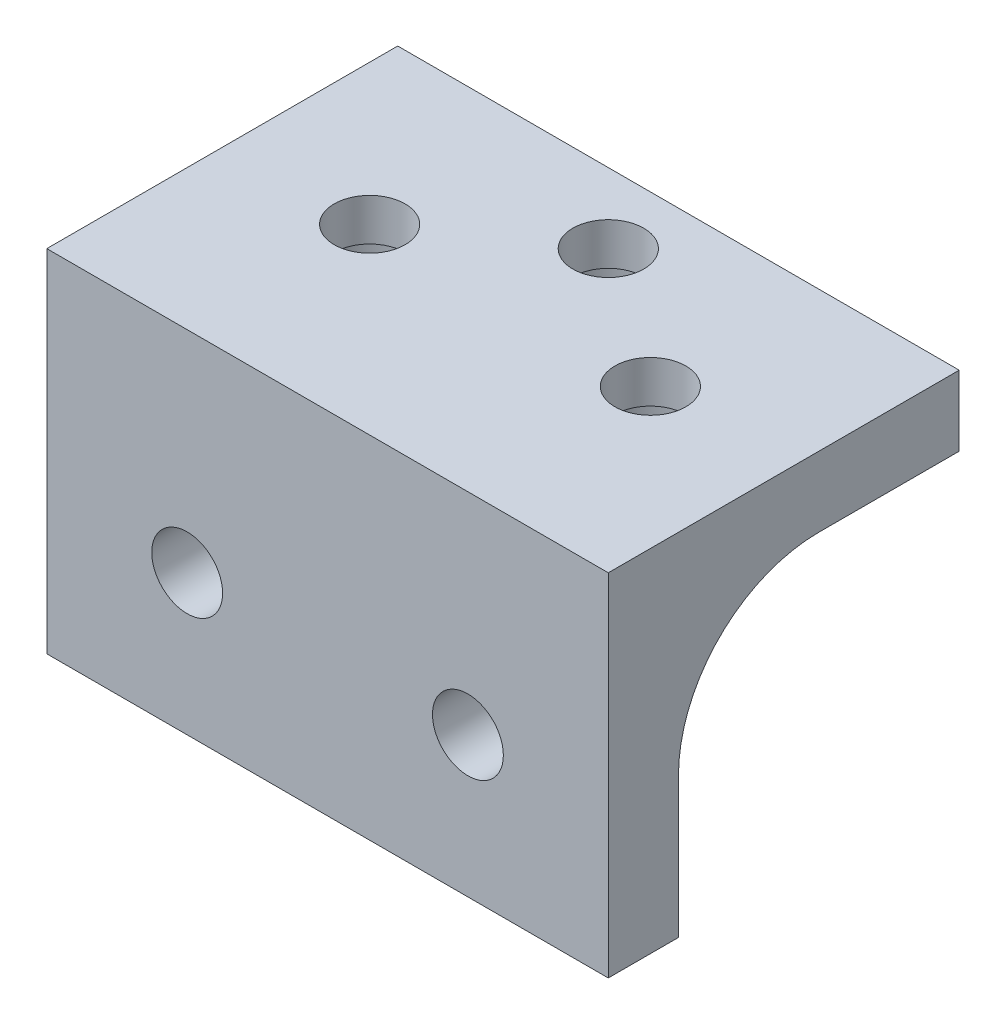
ISO-10303-21;
HEADER;
FILE_DESCRIPTION(('STEP AP214'),'2;1');
FILE_NAME('part.step','',(''),(''),'','','');
FILE_SCHEMA(('AUTOMOTIVE_DESIGN { 1 0 10303 214 1 1 1 1 }'));
ENDSEC;
DATA;
#1=APPLICATION_CONTEXT('core data for automotive mechanical design processes');
#2=APPLICATION_PROTOCOL_DEFINITION('international standard','automotive_design',2000,#1);
#3=PRODUCT_CONTEXT('',#1,'mechanical');
#4=PRODUCT('Part','Part','',(#3));
#5=PRODUCT_RELATED_PRODUCT_CATEGORY('part','',(#4));
#6=PRODUCT_DEFINITION_FORMATION('','',#4);
#7=PRODUCT_DEFINITION_CONTEXT('part definition',#1,'design');
#8=PRODUCT_DEFINITION('design','',#6,#7);
#9=PRODUCT_DEFINITION_SHAPE('','',#8);
#10=(LENGTH_UNIT() NAMED_UNIT(*) SI_UNIT(.MILLI.,.METRE.));
#11=(NAMED_UNIT(*) PLANE_ANGLE_UNIT() SI_UNIT($,.RADIAN.));
#12=(NAMED_UNIT(*) SI_UNIT($,.STERADIAN.) SOLID_ANGLE_UNIT());
#13=UNCERTAINTY_MEASURE_WITH_UNIT(LENGTH_MEASURE(1.E-05),#10,'distance_accuracy_value','');
#14=(GEOMETRIC_REPRESENTATION_CONTEXT(3) GLOBAL_UNCERTAINTY_ASSIGNED_CONTEXT((#13)) GLOBAL_UNIT_ASSIGNED_CONTEXT((#10,
#11,#12)) REPRESENTATION_CONTEXT('',''));
#15=CARTESIAN_POINT('',(0.,0.,0.));
#16=DIRECTION('',(0.,0.,1.));
#17=DIRECTION('',(1.,0.,0.));
#18=AXIS2_PLACEMENT_3D('',#15,#16,#17);
#19=CARTESIAN_POINT('',(20.,25.,-15.));
#20=DIRECTION('',(0.,-1.,0.));
#21=DIRECTION('',(0.,0.,-1.));
#22=AXIS2_PLACEMENT_3D('',#19,#20,#21);
#23=CYLINDRICAL_SURFACE('',#22,2.525);
#24=CARTESIAN_POINT('',(20.,25.,-15.));
#25=DIRECTION('',(0.,-1.,0.));
#26=DIRECTION('',(0.,0.,-1.));
#27=AXIS2_PLACEMENT_3D('',#24,#25,#26);
#28=CIRCLE('',#27,2.525);
#29=CARTESIAN_POINT('',(20.,25.,-17.525));
#30=VERTEX_POINT('',#29);
#31=EDGE_CURVE('E201',#30,#30,#28,.T.);
#32=ORIENTED_EDGE('',*,*,#31,.F.);
#33=EDGE_LOOP('',(#32));
#34=FACE_BOUND('',#33,.T.);
#35=CARTESIAN_POINT('',(20.,22.,-15.));
#36=DIRECTION('',(0.,-1.,0.));
#37=DIRECTION('',(0.,0.,-1.));
#38=AXIS2_PLACEMENT_3D('',#35,#36,#37);
#39=CIRCLE('',#38,2.525);
#40=CARTESIAN_POINT('',(20.,22.,-17.525));
#41=VERTEX_POINT('',#40);
#42=EDGE_CURVE('E198',#41,#41,#39,.F.);
#43=ORIENTED_EDGE('',*,*,#42,.F.);
#44=EDGE_LOOP('',(#43));
#45=FACE_BOUND('',#44,.T.);
#46=ADVANCED_FACE('F39',(#34,#45),#23,.F.);
#47=CARTESIAN_POINT('',(30.,25.,-8.));
#48=DIRECTION('',(0.,-1.,0.));
#49=DIRECTION('',(0.,0.,-1.));
#50=AXIS2_PLACEMENT_3D('',#47,#48,#49);
#51=CYLINDRICAL_SURFACE('',#50,2.525);
#52=CARTESIAN_POINT('',(30.,25.,-8.));
#53=DIRECTION('',(0.,-1.,0.));
#54=DIRECTION('',(0.,0.,-1.));
#55=AXIS2_PLACEMENT_3D('',#52,#53,#54);
#56=CIRCLE('',#55,2.525);
#57=CARTESIAN_POINT('',(30.,25.,-10.525));
#58=VERTEX_POINT('',#57);
#59=EDGE_CURVE('E284',#58,#58,#56,.T.);
#60=ORIENTED_EDGE('',*,*,#59,.F.);
#61=EDGE_LOOP('',(#60));
#62=FACE_BOUND('',#61,.T.);
#63=CARTESIAN_POINT('',(30.,22.,-8.));
#64=DIRECTION('',(0.,-1.,0.));
#65=DIRECTION('',(0.,0.,-1.));
#66=AXIS2_PLACEMENT_3D('',#63,#64,#65);
#67=CIRCLE('',#66,2.525);
#68=CARTESIAN_POINT('',(30.,22.,-10.525));
#69=VERTEX_POINT('',#68);
#70=EDGE_CURVE('E194',#69,#69,#67,.F.);
#71=ORIENTED_EDGE('',*,*,#70,.F.);
#72=EDGE_LOOP('',(#71));
#73=FACE_BOUND('',#72,.T.);
#74=ADVANCED_FACE('F246',(#62,#73),#51,.F.);
#75=CARTESIAN_POINT('',(10.,25.,-8.));
#76=DIRECTION('',(0.,-1.,0.));
#77=DIRECTION('',(0.,0.,-1.));
#78=AXIS2_PLACEMENT_3D('',#75,#76,#77);
#79=CYLINDRICAL_SURFACE('',#78,2.525);
#80=CARTESIAN_POINT('',(10.,25.,-8.));
#81=DIRECTION('',(0.,-1.,0.));
#82=DIRECTION('',(0.,0.,-1.));
#83=AXIS2_PLACEMENT_3D('',#80,#81,#82);
#84=CIRCLE('',#83,2.525);
#85=CARTESIAN_POINT('',(10.,25.,-10.525));
#86=VERTEX_POINT('',#85);
#87=EDGE_CURVE('E142',#86,#86,#84,.T.);
#88=ORIENTED_EDGE('',*,*,#87,.F.);
#89=EDGE_LOOP('',(#88));
#90=FACE_BOUND('',#89,.T.);
#91=CARTESIAN_POINT('',(10.,22.,-8.));
#92=DIRECTION('',(0.,-1.,0.));
#93=DIRECTION('',(0.,0.,-1.));
#94=AXIS2_PLACEMENT_3D('',#91,#92,#93);
#95=CIRCLE('',#94,2.525);
#96=CARTESIAN_POINT('',(10.,22.,-10.525));
#97=VERTEX_POINT('',#96);
#98=EDGE_CURVE('E191',#97,#97,#95,.F.);
#99=ORIENTED_EDGE('',*,*,#98,.F.);
#100=EDGE_LOOP('',(#99));
#101=FACE_BOUND('',#100,.T.);
#102=ADVANCED_FACE('F252',(#90,#101),#79,.F.);
#103=CARTESIAN_POINT('',(40.,0.,5.));
#104=DIRECTION('',(-1.,0.,0.));
#105=DIRECTION('',(0.,0.,1.));
#106=AXIS2_PLACEMENT_3D('',#103,#104,#105);
#107=PLANE('',#106);
#108=DIRECTION('',(0.,1.,0.));
#109=VECTOR('',#108,1.);
#110=CARTESIAN_POINT('',(40.,0.,0.));
#111=LINE('',#110,#109);
#112=CARTESIAN_POINT('',(40.,0.,0.));
#113=VERTEX_POINT('',#112);
#114=CARTESIAN_POINT('',(40.,10.,0.));
#115=VERTEX_POINT('',#114);
#116=EDGE_CURVE('E177',#113,#115,#111,.T.);
#117=ORIENTED_EDGE('',*,*,#116,.T.);
#118=CARTESIAN_POINT('',(40.,10.,-10.));
#119=DIRECTION('',(-1.,0.,0.));
#120=DIRECTION('',(0.,0.,1.));
#121=AXIS2_PLACEMENT_3D('',#118,#119,#120);
#122=CIRCLE('',#121,10.);
#123=CARTESIAN_POINT('',(40.,20.,-10.));
#124=VERTEX_POINT('',#123);
#125=EDGE_CURVE('E55',#115,#124,#122,.T.);
#126=ORIENTED_EDGE('',*,*,#125,.T.);
#127=DIRECTION('',(0.,0.,1.));
#128=VECTOR('',#127,1.);
#129=CARTESIAN_POINT('',(40.,20.,-20.));
#130=LINE('',#129,#128);
#131=CARTESIAN_POINT('',(40.,20.,-20.));
#132=VERTEX_POINT('',#131);
#133=EDGE_CURVE('E130',#132,#124,#130,.T.);
#134=ORIENTED_EDGE('',*,*,#133,.F.);
#135=DIRECTION('',(0.,1.,0.));
#136=VECTOR('',#135,1.);
#137=CARTESIAN_POINT('',(40.,0.,-20.));
#138=LINE('',#137,#136);
#139=CARTESIAN_POINT('',(40.,25.,-20.));
#140=VERTEX_POINT('',#139);
#141=EDGE_CURVE('E147',#132,#140,#138,.T.);
#142=ORIENTED_EDGE('',*,*,#141,.T.);
#143=DIRECTION('',(0.,0.,-1.));
#144=VECTOR('',#143,1.);
#145=CARTESIAN_POINT('',(40.,25.,5.));
#146=LINE('',#145,#144);
#147=CARTESIAN_POINT('',(40.,25.,5.));
#148=VERTEX_POINT('',#147);
#149=EDGE_CURVE('E188',#148,#140,#146,.T.);
#150=ORIENTED_EDGE('',*,*,#149,.F.);
#151=DIRECTION('',(0.,1.,0.));
#152=VECTOR('',#151,1.);
#153=CARTESIAN_POINT('',(40.,0.,5.));
#154=LINE('',#153,#152);
#155=CARTESIAN_POINT('',(40.,0.,5.));
#156=VERTEX_POINT('',#155);
#157=EDGE_CURVE('E162',#156,#148,#154,.T.);
#158=ORIENTED_EDGE('',*,*,#157,.F.);
#159=DIRECTION('',(0.,0.,-1.));
#160=VECTOR('',#159,1.);
#161=CARTESIAN_POINT('',(40.,0.,5.));
#162=LINE('',#161,#160);
#163=EDGE_CURVE('E171',#156,#113,#162,.T.);
#164=ORIENTED_EDGE('',*,*,#163,.T.);
#165=EDGE_LOOP('',(#117,#126,#134,#142,#150,#158,#164));
#166=FACE_BOUND('',#165,.T.);
#167=ADVANCED_FACE('F232',(#166),#107,.F.);
#168=CARTESIAN_POINT('',(0.,25.,5.));
#169=DIRECTION('',(0.,1.,0.));
#170=DIRECTION('',(-1.,0.,0.));
#171=AXIS2_PLACEMENT_3D('',#168,#169,#170);
#172=PLANE('',#171);
#173=ORIENTED_EDGE('',*,*,#87,.T.);
#174=EDGE_LOOP('',(#173));
#175=FACE_BOUND('',#174,.T.);
#176=ORIENTED_EDGE('',*,*,#59,.T.);
#177=EDGE_LOOP('',(#176));
#178=FACE_BOUND('',#177,.T.);
#179=ORIENTED_EDGE('',*,*,#31,.T.);
#180=EDGE_LOOP('',(#179));
#181=FACE_BOUND('',#180,.T.);
#182=ORIENTED_EDGE('',*,*,#149,.T.);
#183=DIRECTION('',(1.,0.,0.));
#184=VECTOR('',#183,1.);
#185=CARTESIAN_POINT('',(0.,25.,-20.));
#186=LINE('',#185,#184);
#187=CARTESIAN_POINT('',(0.,25.,-20.));
#188=VERTEX_POINT('',#187);
#189=EDGE_CURVE('E131',#188,#140,#186,.T.);
#190=ORIENTED_EDGE('',*,*,#189,.F.);
#191=DIRECTION('',(0.,0.,-1.));
#192=VECTOR('',#191,1.);
#193=CARTESIAN_POINT('',(0.,25.,5.));
#194=LINE('',#193,#192);
#195=CARTESIAN_POINT('',(0.,25.,5.));
#196=VERTEX_POINT('',#195);
#197=EDGE_CURVE('E138',#196,#188,#194,.T.);
#198=ORIENTED_EDGE('',*,*,#197,.F.);
#199=DIRECTION('',(1.,0.,0.));
#200=VECTOR('',#199,1.);
#201=CARTESIAN_POINT('',(0.,25.,5.));
#202=LINE('',#201,#200);
#203=EDGE_CURVE('E164',#196,#148,#202,.T.);
#204=ORIENTED_EDGE('',*,*,#203,.T.);
#205=EDGE_LOOP('',(#182,#190,#198,#204));
#206=FACE_BOUND('',#205,.T.);
#207=ADVANCED_FACE('F272',(#175,#178,#181,#206),#172,.T.);
#208=CARTESIAN_POINT('',(0.,0.,5.));
#209=DIRECTION('',(-1.,0.,0.));
#210=DIRECTION('',(0.,-1.,0.));
#211=AXIS2_PLACEMENT_3D('',#208,#209,#210);
#212=PLANE('',#211);
#213=DIRECTION('',(0.,1.,0.));
#214=VECTOR('',#213,1.);
#215=CARTESIAN_POINT('',(0.,0.,0.));
#216=LINE('',#215,#214);
#217=CARTESIAN_POINT('',(0.,0.,0.));
#218=VERTEX_POINT('',#217);
#219=CARTESIAN_POINT('',(0.,10.,0.));
#220=VERTEX_POINT('',#219);
#221=EDGE_CURVE('E179',#218,#220,#216,.T.);
#222=ORIENTED_EDGE('',*,*,#221,.F.);
#223=DIRECTION('',(0.,0.,-1.));
#224=VECTOR('',#223,1.);
#225=CARTESIAN_POINT('',(0.,0.,5.));
#226=LINE('',#225,#224);
#227=CARTESIAN_POINT('',(0.,0.,5.));
#228=VERTEX_POINT('',#227);
#229=EDGE_CURVE('E185',#228,#218,#226,.T.);
#230=ORIENTED_EDGE('',*,*,#229,.F.);
#231=DIRECTION('',(0.,1.,0.));
#232=VECTOR('',#231,1.);
#233=CARTESIAN_POINT('',(0.,0.,5.));
#234=LINE('',#233,#232);
#235=EDGE_CURVE('E167',#228,#196,#234,.T.);
#236=ORIENTED_EDGE('',*,*,#235,.T.);
#237=ORIENTED_EDGE('',*,*,#197,.T.);
#238=DIRECTION('',(0.,1.,0.));
#239=VECTOR('',#238,1.);
#240=CARTESIAN_POINT('',(0.,0.,-20.));
#241=LINE('',#240,#239);
#242=CARTESIAN_POINT('',(0.,20.,-20.));
#243=VERTEX_POINT('',#242);
#244=EDGE_CURVE('E134',#243,#188,#241,.T.);
#245=ORIENTED_EDGE('',*,*,#244,.F.);
#246=DIRECTION('',(0.,0.,1.));
#247=VECTOR('',#246,1.);
#248=CARTESIAN_POINT('',(0.,20.,-20.));
#249=LINE('',#248,#247);
#250=CARTESIAN_POINT('',(0.,20.,-10.));
#251=VERTEX_POINT('',#250);
#252=EDGE_CURVE('E122',#243,#251,#249,.T.);
#253=ORIENTED_EDGE('',*,*,#252,.T.);
#254=CARTESIAN_POINT('',(0.,10.,-10.));
#255=DIRECTION('',(-1.,0.,0.));
#256=DIRECTION('',(0.,-1.,0.));
#257=AXIS2_PLACEMENT_3D('',#254,#255,#256);
#258=CIRCLE('',#257,10.);
#259=EDGE_CURVE('E11',#251,#220,#258,.F.);
#260=ORIENTED_EDGE('',*,*,#259,.T.);
#261=EDGE_LOOP('',(#222,#230,#236,#237,#245,#253,#260));
#262=FACE_BOUND('',#261,.T.);
#263=ADVANCED_FACE('F136',(#262),#212,.T.);
#264=CARTESIAN_POINT('',(10.,10.,5.));
#265=DIRECTION('',(0.,0.,-1.));
#266=DIRECTION('',(-1.,0.,0.));
#267=AXIS2_PLACEMENT_3D('',#264,#265,#266);
#268=CYLINDRICAL_SURFACE('',#267,2.525);
#269=CARTESIAN_POINT('',(10.,10.,5.));
#270=DIRECTION('',(0.,0.,1.));
#271=DIRECTION('',(1.,0.,0.));
#272=AXIS2_PLACEMENT_3D('',#269,#270,#271);
#273=CIRCLE('',#272,2.525);
#274=CARTESIAN_POINT('',(12.525,10.,5.));
#275=VERTEX_POINT('',#274);
#276=EDGE_CURVE('E158',#275,#275,#273,.T.);
#277=ORIENTED_EDGE('',*,*,#276,.T.);
#278=EDGE_LOOP('',(#277));
#279=FACE_BOUND('',#278,.T.);
#280=CARTESIAN_POINT('',(10.,10.,0.));
#281=DIRECTION('',(0.,0.,1.));
#282=DIRECTION('',(1.,0.,0.));
#283=AXIS2_PLACEMENT_3D('',#280,#281,#282);
#284=CIRCLE('',#283,2.525);
#285=CARTESIAN_POINT('',(7.475,10.,0.));
#286=VERTEX_POINT('',#285);
#287=CARTESIAN_POINT('',(12.525,10.,0.));
#288=VERTEX_POINT('',#287);
#289=EDGE_CURVE('E174',#286,#288,#284,.T.);
#290=ORIENTED_EDGE('',*,*,#289,.F.);
#291=CARTESIAN_POINT('',(7.475,10.,0.));
#292=CARTESIAN_POINT('',(7.47499196982632,10.0698409719529,6.95828235710986E-06));
#293=CARTESIAN_POINT('',(7.47789756406876,10.1396773140807,-0.000731507641879494));
#294=CARTESIAN_POINT('',(7.48947370394066,10.2788296145656,-0.00364767272976722));
#295=CARTESIAN_POINT('',(7.49814334136296,10.3481456531641,-0.00582514515710549));
#296=CARTESIAN_POINT('',(7.52116316650093,10.4856363059069,-0.0115622205087932));
#297=CARTESIAN_POINT('',(7.5355024058548,10.5538128575522,-0.0151191593439368));
#298=CARTESIAN_POINT('',(7.56972868811072,10.6886594184644,-0.0235115829206265));
#299=CARTESIAN_POINT('',(7.58961579223927,10.7553294110962,-0.0283470817723901));
#300=CARTESIAN_POINT('',(7.65738343694948,10.9523760484464,-0.0445858062780399));
#301=CARTESIAN_POINT('',(7.7133925069317,11.0799207360251,-0.0577271084386854));
#302=CARTESIAN_POINT('',(7.84534412248801,11.3237597109172,-0.0872402716337782));
#303=CARTESIAN_POINT('',(7.92129144781017,11.4400512913903,-0.103612907073734));
#304=CARTESIAN_POINT('',(8.09265143225131,11.6605703933326,-0.138195133898514));
#305=CARTESIAN_POINT('',(8.18840145296254,11.7645317319755,-0.156433344962551));
#306=CARTESIAN_POINT('',(8.39593018916815,11.9551066472622,-0.192503316394079));
#307=CARTESIAN_POINT('',(8.50771192140793,12.0417169515301,-0.210334999530169));
#308=CARTESIAN_POINT('',(8.74621931265156,12.1963970986497,-0.243862604207678));
#309=CARTESIAN_POINT('',(8.87314605393405,12.2641655548668,-0.259521997836755));
#310=CARTESIAN_POINT('',(9.13704308955822,12.3772946419871,-0.286510610506856));
#311=CARTESIAN_POINT('',(9.27401122219846,12.422660079618,-0.297840758300358));
#312=CARTESIAN_POINT('',(9.55115547129422,12.4887832272335,-0.31459300279048));
#313=CARTESIAN_POINT('',(9.69120917933003,12.510023964747,-0.320130886838143));
#314=CARTESIAN_POINT('',(9.9729963517542,12.528799516634,-0.325018095361305));
#315=CARTESIAN_POINT('',(10.114729571913,12.5263377365107,-0.324368308861997));
#316=CARTESIAN_POINT('',(10.3921336941612,12.4981623886305,-0.317057381290762));
#317=CARTESIAN_POINT('',(10.5278677988897,12.4730262817711,-0.310545541102911));
#318=CARTESIAN_POINT('',(10.7931260404732,12.4011377775216,-0.292482407649228));
#319=CARTESIAN_POINT('',(10.9226497826223,12.3543840082036,-0.28093079454544));
#320=CARTESIAN_POINT('',(11.1733556256041,12.2400978324215,-0.253953315663275));
#321=CARTESIAN_POINT('',(11.2944382127662,12.1723566296583,-0.23848881895796));
#322=CARTESIAN_POINT('',(11.5237211448071,12.0181657527281,-0.205450172476667));
#323=CARTESIAN_POINT('',(11.6319194859136,11.9317131744225,-0.187875695405485));
#324=CARTESIAN_POINT('',(11.8356620946504,11.7395800435904,-0.151971385552159));
#325=CARTESIAN_POINT('',(11.9307482733637,11.6334144918412,-0.133634429347075));
#326=CARTESIAN_POINT('',(12.1018771838078,11.4063933837324,-0.0987261549853846));
#327=CARTESIAN_POINT('',(12.1779150259933,11.2855340674099,-0.0821552907954163));
#328=CARTESIAN_POINT('',(12.3089671298951,11.0318758955082,-0.0525581190806044));
#329=CARTESIAN_POINT('',(12.3638941841739,10.8990302547504,-0.0395465773250007));
#330=CARTESIAN_POINT('',(12.4504385529634,10.6256665883283,-0.0186556145904878));
#331=CARTESIAN_POINT('',(12.4820899983751,10.485160122659,-0.0107686809709509));
#332=CARTESIAN_POINT('',(12.5093883040123,10.2861962361635,-0.00393244950520291));
#333=CARTESIAN_POINT('',(12.5152437606223,10.2290756665121,-0.00245976888303395));
#334=CARTESIAN_POINT('',(12.5230451946559,10.1146457864483,-0.00049405941593525));
#335=CARTESIAN_POINT('',(12.5249975862618,10.0573369409808,5.7670393293516E-07));
#336=CARTESIAN_POINT('',(12.525,10.,0.));
#337=B_SPLINE_CURVE_WITH_KNOTS('',3,(#291,#292,#293,#294,#295,#296,#297,#298,#299,#300,#301,
#302,#303,#304,#305,#306,#307,#308,#309,#310,#311,#312,#313,#314,#315,#316,#317,#318,#319,#320,
#321,#322,#323,#324,#325,#326,#327,#328,#329,#330,#331,#332,#333,#334,#335,#336),.UNSPECIFIED.,
.F.,.F.,(4,2,2,2,2,2,2,2,2,2,2,2,2,2,2,2,2,2,2,2,2,2,4),(0.,0.209450588327675,0.418868182548018,
0.62788333780665,0.836900799857569,1.25454063710085,1.67228068566697,2.09783040948839,
2.52346031586947,2.95555097480624,3.38754888528295,3.81073576270662,4.23386183887802,
4.64650701542589,5.05917838339047,5.47609477788381,5.89307592722935,6.32215230491826,
6.75133871025235,7.18227947724617,7.61258705405089,7.78478989565423,7.95670951077155),.UNSPECIFIED.);
#338=EDGE_CURVE('E213',#286,#288,#337,.T.);
#339=ORIENTED_EDGE('',*,*,#338,.T.);
#340=EDGE_LOOP('',(#290,#339));
#341=FACE_BOUND('',#340,.T.);
#342=ADVANCED_FACE('F226',(#279,#341),#268,.F.);
#343=CARTESIAN_POINT('',(30.,10.,5.));
#344=DIRECTION('',(0.,0.,-1.));
#345=DIRECTION('',(-1.,0.,0.));
#346=AXIS2_PLACEMENT_3D('',#343,#344,#345);
#347=CYLINDRICAL_SURFACE('',#346,2.525);
#348=CARTESIAN_POINT('',(30.,10.,5.));
#349=DIRECTION('',(0.,0.,1.));
#350=DIRECTION('',(1.,0.,0.));
#351=AXIS2_PLACEMENT_3D('',#348,#349,#350);
#352=CIRCLE('',#351,2.525);
#353=CARTESIAN_POINT('',(32.525,10.,5.));
#354=VERTEX_POINT('',#353);
#355=EDGE_CURVE('E155',#354,#354,#352,.T.);
#356=ORIENTED_EDGE('',*,*,#355,.T.);
#357=EDGE_LOOP('',(#356));
#358=FACE_BOUND('',#357,.T.);
#359=CARTESIAN_POINT('',(30.,10.,0.));
#360=DIRECTION('',(0.,0.,1.));
#361=DIRECTION('',(1.,0.,0.));
#362=AXIS2_PLACEMENT_3D('',#359,#360,#361);
#363=CIRCLE('',#362,2.525);
#364=CARTESIAN_POINT('',(27.475,10.,0.));
#365=VERTEX_POINT('',#364);
#366=CARTESIAN_POINT('',(32.525,10.,0.));
#367=VERTEX_POINT('',#366);
#368=EDGE_CURVE('E153',#365,#367,#363,.T.);
#369=ORIENTED_EDGE('',*,*,#368,.F.);
#370=CARTESIAN_POINT('',(27.475,10.,0.));
#371=CARTESIAN_POINT('',(27.4749919698263,10.0698409719529,6.95828235693691E-06));
#372=CARTESIAN_POINT('',(27.4778975640688,10.1396773140807,-0.000731507641879694));
#373=CARTESIAN_POINT('',(27.4894737039407,10.2788296145656,-0.00364767272976735));
#374=CARTESIAN_POINT('',(27.498143341363,10.3481456531641,-0.00582514515710552));
#375=CARTESIAN_POINT('',(27.5211631665009,10.4856363059069,-0.0115622205087931));
#376=CARTESIAN_POINT('',(27.5355024058548,10.5538128575522,-0.0151191593439366));
#377=CARTESIAN_POINT('',(27.5697286881107,10.6886594184644,-0.0235115829206263));
#378=CARTESIAN_POINT('',(27.5896157922393,10.7553294110962,-0.0283470817723899));
#379=CARTESIAN_POINT('',(27.6573834369495,10.9523760484464,-0.0445858062780404));
#380=CARTESIAN_POINT('',(27.7133925069317,11.0799207360251,-0.057727108438687));
#381=CARTESIAN_POINT('',(27.845344122488,11.3237597109172,-0.08724027163378));
#382=CARTESIAN_POINT('',(27.9212914478102,11.4400512913903,-0.103612907073735));
#383=CARTESIAN_POINT('',(28.0926514322513,11.6605703933326,-0.138195133898514));
#384=CARTESIAN_POINT('',(28.1884014529625,11.7645317319755,-0.15643334496255));
#385=CARTESIAN_POINT('',(28.3959301891681,11.9551066472622,-0.192503316394078));
#386=CARTESIAN_POINT('',(28.5077119214079,12.0417169515301,-0.210334999530168));
#387=CARTESIAN_POINT('',(28.7462193126516,12.1963970986497,-0.243862604207679));
#388=CARTESIAN_POINT('',(28.873146053934,12.2641655548668,-0.259521997836755));
#389=CARTESIAN_POINT('',(29.1370430895582,12.3772946419871,-0.286510610506857));
#390=CARTESIAN_POINT('',(29.2740112221984,12.422660079618,-0.297840758300359));
#391=CARTESIAN_POINT('',(29.5511554712942,12.4887832272335,-0.314593002790481));
#392=CARTESIAN_POINT('',(29.69120917933,12.510023964747,-0.320130886838142));
#393=CARTESIAN_POINT('',(29.9729963517542,12.528799516634,-0.325018095361305));
#394=CARTESIAN_POINT('',(30.114729571913,12.5263377365107,-0.324368308861998));
#395=CARTESIAN_POINT('',(30.3921336941612,12.4981623886305,-0.317057381290765));
#396=CARTESIAN_POINT('',(30.5278677988897,12.4730262817711,-0.310545541102914));
#397=CARTESIAN_POINT('',(30.7931260404732,12.4011377775216,-0.292482407649231));
#398=CARTESIAN_POINT('',(30.9226497826223,12.3543840082036,-0.280930794545443));
#399=CARTESIAN_POINT('',(31.1733556256041,12.2400978324215,-0.253953315663277));
#400=CARTESIAN_POINT('',(31.2944382127662,12.1723566296583,-0.238488818957962));
#401=CARTESIAN_POINT('',(31.5237211448071,12.0181657527281,-0.205450172476668));
#402=CARTESIAN_POINT('',(31.6319194859136,11.9317131744225,-0.187875695405486));
#403=CARTESIAN_POINT('',(31.8356620946504,11.7395800435904,-0.15197138555216));
#404=CARTESIAN_POINT('',(31.9307482733637,11.6334144918412,-0.133634429347076));
#405=CARTESIAN_POINT('',(32.1018771838078,11.4063933837324,-0.098726154985385));
#406=CARTESIAN_POINT('',(32.1779150259933,11.2855340674099,-0.0821552907954172));
#407=CARTESIAN_POINT('',(32.3089671298951,11.0318758955082,-0.0525581190806053));
#408=CARTESIAN_POINT('',(32.3638941841739,10.8990302547504,-0.0395465773250011));
#409=CARTESIAN_POINT('',(32.4504385529634,10.6256665883283,-0.0186556145904874));
#410=CARTESIAN_POINT('',(32.4820899983751,10.485160122659,-0.0107686809709502));
#411=CARTESIAN_POINT('',(32.5093883040123,10.2861962361635,-0.00393244950520225));
#412=CARTESIAN_POINT('',(32.5152437606223,10.2290756665121,-0.00245976888303338));
#413=CARTESIAN_POINT('',(32.5230451946559,10.1146457864483,-0.000494059415935095));
#414=CARTESIAN_POINT('',(32.5249975862618,10.0573369409808,5.76703932768576E-07));
#415=CARTESIAN_POINT('',(32.525,10.,0.));
#416=B_SPLINE_CURVE_WITH_KNOTS('',3,(#370,#371,#372,#373,#374,#375,#376,#377,#378,#379,#380,
#381,#382,#383,#384,#385,#386,#387,#388,#389,#390,#391,#392,#393,#394,#395,#396,#397,#398,#399,
#400,#401,#402,#403,#404,#405,#406,#407,#408,#409,#410,#411,#412,#413,#414,#415),.UNSPECIFIED.,
.F.,.F.,(4,2,2,2,2,2,2,2,2,2,2,2,2,2,2,2,2,2,2,2,2,2,4),(0.,0.209450588327675,0.418868182548018,
0.627883337806649,0.836900799857568,1.25454063710085,1.67228068566697,2.09783040948838,
2.52346031586946,2.95555097480623,3.38754888528295,3.81073576270662,4.23386183887803,
4.64650701542589,5.05917838339047,5.4760947778838,5.89307592722935,6.32215230491826,
6.75133871025235,7.18227947724617,7.61258705405089,7.78478989565423,7.95670951077156),.UNSPECIFIED.);
#417=EDGE_CURVE('E220',#365,#367,#416,.T.);
#418=ORIENTED_EDGE('',*,*,#417,.T.);
#419=EDGE_LOOP('',(#369,#418));
#420=FACE_BOUND('',#419,.T.);
#421=ADVANCED_FACE('F230',(#358,#420),#347,.F.);
#422=CARTESIAN_POINT('',(0.,0.,5.));
#423=DIRECTION('',(0.,1.,0.));
#424=DIRECTION('',(0.,0.,1.));
#425=AXIS2_PLACEMENT_3D('',#422,#423,#424);
#426=PLANE('',#425);
#427=DIRECTION('',(1.,0.,0.));
#428=VECTOR('',#427,1.);
#429=CARTESIAN_POINT('',(0.,0.,0.));
#430=LINE('',#429,#428);
#431=EDGE_CURVE('E159',#218,#113,#430,.T.);
#432=ORIENTED_EDGE('',*,*,#431,.T.);
#433=ORIENTED_EDGE('',*,*,#163,.F.);
#434=DIRECTION('',(1.,0.,0.));
#435=VECTOR('',#434,1.);
#436=CARTESIAN_POINT('',(0.,0.,5.));
#437=LINE('',#436,#435);
#438=EDGE_CURVE('E169',#228,#156,#437,.T.);
#439=ORIENTED_EDGE('',*,*,#438,.F.);
#440=ORIENTED_EDGE('',*,*,#229,.T.);
#441=EDGE_LOOP('',(#432,#433,#439,#440));
#442=FACE_BOUND('',#441,.T.);
#443=ADVANCED_FACE('F236',(#442),#426,.F.);
#444=CARTESIAN_POINT('',(0.,0.,5.));
#445=DIRECTION('',(0.,0.,1.));
#446=DIRECTION('',(1.,0.,0.));
#447=AXIS2_PLACEMENT_3D('',#444,#445,#446);
#448=PLANE('',#447);
#449=ORIENTED_EDGE('',*,*,#355,.F.);
#450=EDGE_LOOP('',(#449));
#451=FACE_BOUND('',#450,.T.);
#452=ORIENTED_EDGE('',*,*,#276,.F.);
#453=EDGE_LOOP('',(#452));
#454=FACE_BOUND('',#453,.T.);
#455=ORIENTED_EDGE('',*,*,#157,.T.);
#456=ORIENTED_EDGE('',*,*,#203,.F.);
#457=ORIENTED_EDGE('',*,*,#235,.F.);
#458=ORIENTED_EDGE('',*,*,#438,.T.);
#459=EDGE_LOOP('',(#455,#456,#457,#458));
#460=FACE_BOUND('',#459,.T.);
#461=ADVANCED_FACE('F241',(#451,#454,#460),#448,.T.);
#462=CARTESIAN_POINT('',(0.,0.,0.));
#463=DIRECTION('',(0.,0.,1.));
#464=DIRECTION('',(1.,0.,0.));
#465=AXIS2_PLACEMENT_3D('',#462,#463,#464);
#466=PLANE('',#465);
#467=ORIENTED_EDGE('',*,*,#221,.T.);
#468=DIRECTION('',(1.,0.,0.));
#469=VECTOR('',#468,1.);
#470=CARTESIAN_POINT('',(0.,10.,0.));
#471=LINE('',#470,#469);
#472=EDGE_CURVE('E205',#220,#286,#471,.T.);
#473=ORIENTED_EDGE('',*,*,#472,.T.);
#474=ORIENTED_EDGE('',*,*,#289,.T.);
#475=DIRECTION('',(1.,0.,0.));
#476=VECTOR('',#475,1.);
#477=CARTESIAN_POINT('',(0.,10.,0.));
#478=LINE('',#477,#476);
#479=EDGE_CURVE('E203',#288,#365,#478,.T.);
#480=ORIENTED_EDGE('',*,*,#479,.T.);
#481=ORIENTED_EDGE('',*,*,#368,.T.);
#482=DIRECTION('',(1.,0.,0.));
#483=VECTOR('',#482,1.);
#484=CARTESIAN_POINT('',(0.,10.,0.));
#485=LINE('',#484,#483);
#486=EDGE_CURVE('E190',#367,#115,#485,.T.);
#487=ORIENTED_EDGE('',*,*,#486,.T.);
#488=ORIENTED_EDGE('',*,*,#116,.F.);
#489=ORIENTED_EDGE('',*,*,#431,.F.);
#490=EDGE_LOOP('',(#467,#473,#474,#480,#481,#487,#488,#489));
#491=FACE_BOUND('',#490,.T.);
#492=ADVANCED_FACE('F264',(#491),#466,.F.);
#493=CARTESIAN_POINT('',(0.,20.,-20.));
#494=DIRECTION('',(0.,-1.,0.));
#495=DIRECTION('',(0.,0.,-1.));
#496=AXIS2_PLACEMENT_3D('',#493,#494,#495);
#497=PLANE('',#496);
#498=ORIENTED_EDGE('',*,*,#133,.T.);
#499=DIRECTION('',(1.,0.,0.));
#500=VECTOR('',#499,1.);
#501=CARTESIAN_POINT('',(0.,20.,-10.));
#502=LINE('',#501,#500);
#503=CARTESIAN_POINT('',(33.4929393066585,20.,-10.));
#504=VERTEX_POINT('',#503);
#505=EDGE_CURVE('E211',#124,#504,#502,.F.);
#506=ORIENTED_EDGE('',*,*,#505,.T.);
#507=CARTESIAN_POINT('',(30.,20.,-8.));
#508=DIRECTION('',(0.,-1.,0.));
#509=DIRECTION('',(0.,0.,-1.));
#510=AXIS2_PLACEMENT_3D('',#507,#508,#509);
#511=CIRCLE('',#510,4.025);
#512=CARTESIAN_POINT('',(26.5070606933415,20.,-10.));
#513=VERTEX_POINT('',#512);
#514=EDGE_CURVE('E347',#513,#504,#511,.T.);
#515=ORIENTED_EDGE('',*,*,#514,.F.);
#516=DIRECTION('',(1.,0.,0.));
#517=VECTOR('',#516,1.);
#518=CARTESIAN_POINT('',(0.,20.,-10.));
#519=LINE('',#518,#517);
#520=CARTESIAN_POINT('',(13.4929393066585,20.,-10.));
#521=VERTEX_POINT('',#520);
#522=EDGE_CURVE('E209',#513,#521,#519,.F.);
#523=ORIENTED_EDGE('',*,*,#522,.T.);
#524=CARTESIAN_POINT('',(10.,20.,-8.));
#525=DIRECTION('',(0.,-1.,0.));
#526=DIRECTION('',(0.,0.,-1.));
#527=AXIS2_PLACEMENT_3D('',#524,#525,#526);
#528=CIRCLE('',#527,4.025);
#529=CARTESIAN_POINT('',(6.50706069334149,20.,-10.));
#530=VERTEX_POINT('',#529);
#531=EDGE_CURVE('E353',#530,#521,#528,.T.);
#532=ORIENTED_EDGE('',*,*,#531,.F.);
#533=DIRECTION('',(1.,0.,0.));
#534=VECTOR('',#533,1.);
#535=CARTESIAN_POINT('',(0.,20.,-10.));
#536=LINE('',#535,#534);
#537=EDGE_CURVE('E63',#530,#251,#536,.F.);
#538=ORIENTED_EDGE('',*,*,#537,.T.);
#539=ORIENTED_EDGE('',*,*,#252,.F.);
#540=DIRECTION('',(1.,0.,0.));
#541=VECTOR('',#540,1.);
#542=CARTESIAN_POINT('',(0.,20.,-20.));
#543=LINE('',#542,#541);
#544=EDGE_CURVE('E127',#243,#132,#543,.T.);
#545=ORIENTED_EDGE('',*,*,#544,.T.);
#546=EDGE_LOOP('',(#498,#506,#515,#523,#532,#538,#539,#545));
#547=FACE_BOUND('',#546,.T.);
#548=CARTESIAN_POINT('',(20.,20.,-15.));
#549=DIRECTION('',(0.,-1.,0.));
#550=DIRECTION('',(0.,0.,-1.));
#551=AXIS2_PLACEMENT_3D('',#548,#549,#550);
#552=CIRCLE('',#551,4.025);
#553=CARTESIAN_POINT('',(20.,20.,-19.025));
#554=VERTEX_POINT('',#553);
#555=EDGE_CURVE('E344',#554,#554,#552,.T.);
#556=ORIENTED_EDGE('',*,*,#555,.F.);
#557=EDGE_LOOP('',(#556));
#558=FACE_BOUND('',#557,.T.);
#559=ADVANCED_FACE('F124',(#547,#558),#497,.T.);
#560=CARTESIAN_POINT('',(0.,0.,-20.));
#561=DIRECTION('',(0.,0.,1.));
#562=DIRECTION('',(1.,0.,0.));
#563=AXIS2_PLACEMENT_3D('',#560,#561,#562);
#564=PLANE('',#563);
#565=ORIENTED_EDGE('',*,*,#244,.T.);
#566=ORIENTED_EDGE('',*,*,#189,.T.);
#567=ORIENTED_EDGE('',*,*,#141,.F.);
#568=ORIENTED_EDGE('',*,*,#544,.F.);
#569=EDGE_LOOP('',(#565,#566,#567,#568));
#570=FACE_BOUND('',#569,.T.);
#571=ADVANCED_FACE('F145',(#570),#564,.F.);
#572=CARTESIAN_POINT('',(10.,22.,-8.));
#573=DIRECTION('',(0.,-1.,0.));
#574=DIRECTION('',(0.,0.,-1.));
#575=AXIS2_PLACEMENT_3D('',#572,#573,#574);
#576=PLANE('',#575);
#577=CARTESIAN_POINT('',(10.,22.,-8.));
#578=DIRECTION('',(0.,-1.,0.));
#579=DIRECTION('',(0.,0.,-1.));
#580=AXIS2_PLACEMENT_3D('',#577,#578,#579);
#581=CIRCLE('',#580,4.025);
#582=CARTESIAN_POINT('',(10.,22.,-12.025));
#583=VERTEX_POINT('',#582);
#584=EDGE_CURVE('E350',#583,#583,#581,.T.);
#585=ORIENTED_EDGE('',*,*,#584,.T.);
#586=EDGE_LOOP('',(#585));
#587=FACE_BOUND('',#586,.T.);
#588=ORIENTED_EDGE('',*,*,#98,.T.);
#589=EDGE_LOOP('',(#588));
#590=FACE_BOUND('',#589,.T.);
#591=ADVANCED_FACE('F261',(#587,#590),#576,.T.);
#592=CARTESIAN_POINT('',(10.,22.,-8.));
#593=DIRECTION('',(0.,-1.,0.));
#594=DIRECTION('',(0.,0.,-1.));
#595=AXIS2_PLACEMENT_3D('',#592,#593,#594);
#596=CYLINDRICAL_SURFACE('',#595,4.025);
#597=ORIENTED_EDGE('',*,*,#584,.F.);
#598=EDGE_LOOP('',(#597));
#599=FACE_BOUND('',#598,.T.);
#600=ORIENTED_EDGE('',*,*,#531,.T.);
#601=CARTESIAN_POINT('',(13.4929393066585,20.,-10.));
#602=CARTESIAN_POINT('',(13.5460736328344,20.0000111863478,-9.90723243617562));
#603=CARTESIAN_POINT('',(13.5954892671894,19.9987096633441,-9.81232900064868));
#604=CARTESIAN_POINT('',(13.6865947152458,19.9932029324971,-9.61896126256286));
#605=CARTESIAN_POINT('',(13.7282842412366,19.9889976165478,-9.52049682756002));
#606=CARTESIAN_POINT('',(13.8035707740478,19.9774164149736,-9.32092183947502));
#607=CARTESIAN_POINT('',(13.8371835679422,19.9700467943461,-9.21981688390357));
#608=CARTESIAN_POINT('',(13.8962279888304,19.9519524688492,-9.01554565803108));
#609=CARTESIAN_POINT('',(13.9216600741135,19.9412279519899,-8.91237950354395));
#610=CARTESIAN_POINT('',(13.9642512508062,19.916305272308,-8.70468653775737));
#611=CARTESIAN_POINT('',(13.9814042046211,19.9021045441726,-8.60015877582548));
#612=CARTESIAN_POINT('',(14.0073979851557,19.8702062656567,-8.39056801575896));
#613=CARTESIAN_POINT('',(14.0162357211487,19.8525074179973,-8.28550483318798));
#614=CARTESIAN_POINT('',(14.0256568352313,19.8136849247499,-8.07569333800282));
#615=CARTESIAN_POINT('',(14.0262443539852,19.7925630025382,-7.97094489382049));
#616=CARTESIAN_POINT('',(14.0193386561479,19.7470334294146,-7.76242044865847));
#617=CARTESIAN_POINT('',(14.0118423556728,19.7226245276676,-7.65864483404113));
#618=CARTESIAN_POINT('',(13.9773181656963,19.6442928787843,-7.34796093879841));
#619=CARTESIAN_POINT('',(13.9381813977392,19.585593806,-7.14346530636035));
#620=CARTESIAN_POINT('',(13.8302044630593,19.4580514940931,-6.7459231163182));
#621=CARTESIAN_POINT('',(13.7613497656634,19.3892033033854,-6.55288221212859));
#622=CARTESIAN_POINT('',(13.5894307799905,19.2381620773564,-6.16552821835652));
#623=CARTESIAN_POINT('',(13.4839236180873,19.1553299211837,-5.97254792717449));
#624=CARTESIAN_POINT('',(13.2439644080104,18.9857976272188,-5.60726849780763));
#625=CARTESIAN_POINT('',(13.1094874646318,18.8990942137814,-5.43498734705319));
#626=CARTESIAN_POINT('',(12.799492980072,18.7184612009776,-5.0981200671735));
#627=CARTESIAN_POINT('',(12.6212350529142,18.6246628181925,-4.93597091690376));
#628=CARTESIAN_POINT('',(12.2356427165926,18.4466210064006,-4.64427531617639));
#629=CARTESIAN_POINT('',(12.0283337527559,18.3623693311489,-4.51470060885209));
#630=CARTESIAN_POINT('',(11.6361895976488,18.22925630832,-4.31754375316237));
#631=CARTESIAN_POINT('',(11.4563561410196,18.1766848538678,-4.2426012547738));
#632=CARTESIAN_POINT('',(11.1773060825335,18.1102614814742,-4.14977832319481));
#633=CARTESIAN_POINT('',(11.0827424673831,18.0901930847267,-4.12210303169023));
#634=CARTESIAN_POINT('',(10.8910280049013,18.0547460190149,-4.0736205679079));
#635=CARTESIAN_POINT('',(10.7938782910341,18.0393653311036,-4.05281043855789));
#636=CARTESIAN_POINT('',(10.5969661520511,18.0136856765328,-4.01825191424606));
#637=CARTESIAN_POINT('',(10.4971903873053,18.0034222457638,-4.0045528747356));
#638=CARTESIAN_POINT('',(10.2965177635022,17.9884903042506,-3.98467142164764));
#639=CARTESIAN_POINT('',(10.1956214249714,17.9838192971141,-3.97848565421576));
#640=CARTESIAN_POINT('',(9.99353200007857,17.9802359479928,-3.97373695193597));
#641=CARTESIAN_POINT('',(9.8923388896438,17.9813240868426,-3.9751746535762));
#642=CARTESIAN_POINT('',(9.6906006851146,17.9892089975164,-3.98563629529591));
#643=CARTESIAN_POINT('',(9.59005555507179,17.9960054498614,-3.99465981081785));
#644=CARTESIAN_POINT('',(9.31031981664045,18.0227616575394,-4.03039436159012));
#645=CARTESIAN_POINT('',(9.13270108007293,18.0489061780444,-4.06548583395463));
#646=CARTESIAN_POINT('',(8.78657012362815,18.1163462839384,-4.15807103616558));
#647=CARTESIAN_POINT('',(8.61806122891525,18.1576473593193,-4.2155728839439));
#648=CARTESIAN_POINT('',(8.28002557196844,18.255523414771,-4.35604737844874));
#649=CARTESIAN_POINT('',(8.11146337057211,18.313044980363,-4.44066905598056));
#650=CARTESIAN_POINT('',(7.79014877231094,18.437040288046,-4.6307151352812));
#651=CARTESIAN_POINT('',(7.63740489296578,18.5035188092185,-4.73615065657057));
#652=CARTESIAN_POINT('',(7.32175972266526,18.6544359820523,-4.98740917514459));
#653=CARTESIAN_POINT('',(7.16241908804463,18.7398907552267,-5.13709938690943));
#654=CARTESIAN_POINT('',(6.87004013494846,18.9119113590009,-5.46003497956319));
#655=CARTESIAN_POINT('',(6.73702309649835,18.99847802875,-5.63329922834859));
#656=CARTESIAN_POINT('',(6.55273498447655,19.1299402353484,-5.918718752228));
#657=CARTESIAN_POINT('',(6.4913935040154,19.1762700696901,-6.02384378721702));
#658=CARTESIAN_POINT('',(6.37818837857887,19.2668935401489,-6.2398963877805));
#659=CARTESIAN_POINT('',(6.32632114397455,19.3111879426756,-6.35082173514108));
#660=CARTESIAN_POINT('',(6.23260523250471,19.3970087906883,-6.57787180941017));
#661=CARTESIAN_POINT('',(6.19075752033936,19.4385349693666,-6.69399703569698));
#662=CARTESIAN_POINT('',(6.11768126706954,19.5181168452269,-6.93063223053476));
#663=CARTESIAN_POINT('',(6.08644682160104,19.5561744633832,-7.05113971970238));
#664=CARTESIAN_POINT('',(6.03647310373532,19.626353558143,-7.28929643623132));
#665=CARTESIAN_POINT('',(6.01716576590797,19.6586813969936,-7.4067655244334));
#666=CARTESIAN_POINT('',(5.98900343700551,19.7192554455553,-7.64393515806545));
#667=CARTESIAN_POINT('',(5.9801431984577,19.7475036981389,-7.76363455251665));
#668=CARTESIAN_POINT('',(5.97320214316536,19.799611768781,-8.00431193608816));
#669=CARTESIAN_POINT('',(5.9751222928174,19.8234711932095,-8.12529003886665));
#670=CARTESIAN_POINT('',(5.98996802689051,19.8665937002635,-8.36738270345615));
#671=CARTESIAN_POINT('',(6.00289200408726,19.8858574536089,-8.48849724275928));
#672=CARTESIAN_POINT('',(6.037861943662,19.917944077985,-8.71693513275711));
#673=CARTESIAN_POINT('',(6.05880050891637,19.9312322882522,-8.82436424555));
#674=CARTESIAN_POINT('',(6.10947649109438,19.9541508665359,-9.03752051243751));
#675=CARTESIAN_POINT('',(6.13921319391292,19.9637815312742,-9.14324780392722));
#676=CARTESIAN_POINT('',(6.20725453380788,19.9795263502045,-9.35193631572667));
#677=CARTESIAN_POINT('',(6.24554215463247,19.9856474033645,-9.4549025808347));
#678=CARTESIAN_POINT('',(6.33045116071249,19.9946441261455,-9.65743171327501));
#679=CARTESIAN_POINT('',(6.3770672237444,19.9975218598504,-9.75699670604153));
#680=CARTESIAN_POINT('',(6.44040229084808,19.999298186842,-9.87900372971881));
#681=CARTESIAN_POINT('',(6.45339202452089,19.9995629884133,-9.90340797959059));
#682=CARTESIAN_POINT('',(6.47985913072043,19.9999137614862,-9.95192089969273));
#683=CARTESIAN_POINT('',(6.49333601321231,19.9999999078735,-9.97602983599561));
#684=CARTESIAN_POINT('',(6.50706069334149,20.,-10.));
#685=B_SPLINE_CURVE_WITH_KNOTS('',3,(#601,#602,#603,#604,#605,#606,#607,#608,#609,#610,#611,
#612,#613,#614,#615,#616,#617,#618,#619,#620,#621,#622,#623,#624,#625,#626,#627,#628,#629,#630,
#631,#632,#633,#634,#635,#636,#637,#638,#639,#640,#641,#642,#643,#644,#645,#646,#647,#648,#649,
#650,#651,#652,#653,#654,#655,#656,#657,#658,#659,#660,#661,#662,#663,#664,#665,#666,#667,#668,
#669,#670,#671,#672,#673,#674,#675,#676,#677,#678,#679,#680,#681,#682,#683,#684),.UNSPECIFIED.,
.F.,.F.,(4,2,2,2,2,2,2,2,2,2,2,2,2,2,2,2,2,2,2,2,2,2,2,2,2,2,2,2,2,2,2,2,2,2,2,2,2,2,2,2,2,4),
(0.,0.320635576210436,0.641283090082945,0.961298661252984,1.28129630179132,1.60153080421223,
1.92188428929165,2.24207698784975,2.56239187945661,3.20836191774514,3.85464816353009,
4.55680722097947,5.25957210368509,6.03168590346833,6.80312759996893,7.40584113973802,
7.7071793831374,8.00838765932629,8.31165946260445,8.61479583837409,8.91795752358542,
9.22110224278435,9.76727549591382,10.3136467789462,10.903038366225,11.492745684471,
12.1942076657428,12.8962344138206,13.2865158506531,13.6766491084442,14.0668199139731,
14.4567733032475,14.8263319973695,15.1957049867003,15.5651110886132,15.9344632441481,
16.2648119502394,16.5951338507696,16.9248041798185,17.2542645843923,17.3372026567998,
17.420059502682),.UNSPECIFIED.);
#686=EDGE_CURVE('E48',#521,#530,#685,.T.);
#687=ORIENTED_EDGE('',*,*,#686,.T.);
#688=EDGE_LOOP('',(#600,#687));
#689=FACE_BOUND('',#688,.T.);
#690=ADVANCED_FACE('F319',(#599,#689),#596,.F.);
#691=CARTESIAN_POINT('',(30.,22.,-8.));
#692=DIRECTION('',(0.,-1.,0.));
#693=DIRECTION('',(0.,0.,-1.));
#694=AXIS2_PLACEMENT_3D('',#691,#692,#693);
#695=PLANE('',#694);
#696=CARTESIAN_POINT('',(30.,22.,-8.));
#697=DIRECTION('',(0.,-1.,0.));
#698=DIRECTION('',(0.,0.,-1.));
#699=AXIS2_PLACEMENT_3D('',#696,#697,#698);
#700=CIRCLE('',#699,4.025);
#701=CARTESIAN_POINT('',(30.,22.,-12.025));
#702=VERTEX_POINT('',#701);
#703=EDGE_CURVE('E356',#702,#702,#700,.T.);
#704=ORIENTED_EDGE('',*,*,#703,.T.);
#705=EDGE_LOOP('',(#704));
#706=FACE_BOUND('',#705,.T.);
#707=ORIENTED_EDGE('',*,*,#70,.T.);
#708=EDGE_LOOP('',(#707));
#709=FACE_BOUND('',#708,.T.);
#710=ADVANCED_FACE('F316',(#706,#709),#695,.T.);
#711=CARTESIAN_POINT('',(30.,22.,-8.));
#712=DIRECTION('',(0.,-1.,0.));
#713=DIRECTION('',(0.,0.,-1.));
#714=AXIS2_PLACEMENT_3D('',#711,#712,#713);
#715=CYLINDRICAL_SURFACE('',#714,4.025);
#716=ORIENTED_EDGE('',*,*,#703,.F.);
#717=EDGE_LOOP('',(#716));
#718=FACE_BOUND('',#717,.T.);
#719=ORIENTED_EDGE('',*,*,#514,.T.);
#720=CARTESIAN_POINT('',(33.4929393066585,20.,-10.));
#721=CARTESIAN_POINT('',(33.5460736328344,20.0000111863478,-9.90723243617562));
#722=CARTESIAN_POINT('',(33.5954892671894,19.9987096633441,-9.81232900064868));
#723=CARTESIAN_POINT('',(33.6865947152458,19.9932029324971,-9.61896126256286));
#724=CARTESIAN_POINT('',(33.7282842412366,19.9889976165478,-9.52049682756002));
#725=CARTESIAN_POINT('',(33.8035707740478,19.9774164149736,-9.32092183947502));
#726=CARTESIAN_POINT('',(33.8371835679422,19.9700467943461,-9.21981688390356));
#727=CARTESIAN_POINT('',(33.8962279888304,19.9519524688492,-9.01554565803107));
#728=CARTESIAN_POINT('',(33.9216600741135,19.9412279519899,-8.91237950354394));
#729=CARTESIAN_POINT('',(33.9642512508062,19.916305272308,-8.70468653775737));
#730=CARTESIAN_POINT('',(33.9814042046211,19.9021045441726,-8.60015877582548));
#731=CARTESIAN_POINT('',(34.0073979851557,19.8702062656567,-8.39056801575895));
#732=CARTESIAN_POINT('',(34.0162357211487,19.8525074179973,-8.28550483318797));
#733=CARTESIAN_POINT('',(34.0256568352313,19.8136849247499,-8.07569333800281));
#734=CARTESIAN_POINT('',(34.0262443539852,19.7925630025382,-7.97094489382048));
#735=CARTESIAN_POINT('',(34.0193386561479,19.7470334294146,-7.76242044865846));
#736=CARTESIAN_POINT('',(34.0118423556728,19.7226245276676,-7.65864483404112));
#737=CARTESIAN_POINT('',(33.9773181656963,19.6442928787843,-7.3479609387984));
#738=CARTESIAN_POINT('',(33.9381813977392,19.585593806,-7.14346530636034));
#739=CARTESIAN_POINT('',(33.8302044630593,19.4580514940931,-6.74592311631819));
#740=CARTESIAN_POINT('',(33.7613497656634,19.3892033033853,-6.55288221212858));
#741=CARTESIAN_POINT('',(33.5894307799905,19.2381620773564,-6.16552821835651));
#742=CARTESIAN_POINT('',(33.4839236180873,19.1553299211837,-5.97254792717449));
#743=CARTESIAN_POINT('',(33.2439644080104,18.9857976272188,-5.60726849780762));
#744=CARTESIAN_POINT('',(33.1094874646318,18.8990942137814,-5.43498734705318));
#745=CARTESIAN_POINT('',(32.799492980072,18.7184612009776,-5.09812006717349));
#746=CARTESIAN_POINT('',(32.6212350529142,18.6246628181925,-4.93597091690375));
#747=CARTESIAN_POINT('',(32.2356427165926,18.4466210064006,-4.64427531617639));
#748=CARTESIAN_POINT('',(32.0283337527559,18.3623693311489,-4.51470060885208));
#749=CARTESIAN_POINT('',(31.6361895976488,18.22925630832,-4.31754375316237));
#750=CARTESIAN_POINT('',(31.4563561410196,18.1766848538678,-4.2426012547738));
#751=CARTESIAN_POINT('',(31.1773060825335,18.1102614814742,-4.14977832319481));
#752=CARTESIAN_POINT('',(31.0827424673831,18.0901930847267,-4.12210303169022));
#753=CARTESIAN_POINT('',(30.8910280049013,18.0547460190149,-4.07362056790789));
#754=CARTESIAN_POINT('',(30.7938782910341,18.0393653311036,-4.05281043855788));
#755=CARTESIAN_POINT('',(30.5969661520511,18.0136856765328,-4.01825191424606));
#756=CARTESIAN_POINT('',(30.4971903873053,18.0034222457638,-4.0045528747356));
#757=CARTESIAN_POINT('',(30.2965177635021,17.9884903042506,-3.98467142164763));
#758=CARTESIAN_POINT('',(30.1956214249714,17.9838192971141,-3.97848565421576));
#759=CARTESIAN_POINT('',(29.9935320000786,17.9802359479927,-3.97373695193597));
#760=CARTESIAN_POINT('',(29.8923388896438,17.9813240868426,-3.9751746535762));
#761=CARTESIAN_POINT('',(29.6906006851146,17.9892089975164,-3.98563629529591));
#762=CARTESIAN_POINT('',(29.5900555550718,17.9960054498614,-3.99465981081785));
#763=CARTESIAN_POINT('',(29.3103198166404,18.0227616575394,-4.03039436159012));
#764=CARTESIAN_POINT('',(29.1327010800729,18.0489061780444,-4.06548583395463));
#765=CARTESIAN_POINT('',(28.7865701236281,18.1163462839384,-4.15807103616558));
#766=CARTESIAN_POINT('',(28.6180612289152,18.1576473593193,-4.21557288394391));
#767=CARTESIAN_POINT('',(28.2800255719684,18.255523414771,-4.35604737844875));
#768=CARTESIAN_POINT('',(28.1114633705721,18.313044980363,-4.44066905598056));
#769=CARTESIAN_POINT('',(27.7901487723109,18.437040288046,-4.63071513528121));
#770=CARTESIAN_POINT('',(27.6374048929658,18.5035188092185,-4.73615065657057));
#771=CARTESIAN_POINT('',(27.3217597226652,18.6544359820523,-4.9874091751446));
#772=CARTESIAN_POINT('',(27.1624190880446,18.7398907552267,-5.13709938690944));
#773=CARTESIAN_POINT('',(26.8700401349484,18.9119113590009,-5.4600349795632));
#774=CARTESIAN_POINT('',(26.7370230964983,18.99847802875,-5.6332992283486));
#775=CARTESIAN_POINT('',(26.5527349844765,19.1299402353484,-5.91871875222801));
#776=CARTESIAN_POINT('',(26.4913935040154,19.1762700696901,-6.02384378721703));
#777=CARTESIAN_POINT('',(26.3781883785789,19.2668935401489,-6.23989638778051));
#778=CARTESIAN_POINT('',(26.3263211439745,19.3111879426756,-6.35082173514109));
#779=CARTESIAN_POINT('',(26.2326052325047,19.3970087906883,-6.57787180941018));
#780=CARTESIAN_POINT('',(26.1907575203393,19.4385349693666,-6.69399703569699));
#781=CARTESIAN_POINT('',(26.1176812670695,19.5181168452269,-6.93063223053478));
#782=CARTESIAN_POINT('',(26.086446821601,19.5561744633832,-7.05113971970239));
#783=CARTESIAN_POINT('',(26.0364731037353,19.626353558143,-7.28929643623133));
#784=CARTESIAN_POINT('',(26.017165765908,19.6586813969936,-7.40676552443341));
#785=CARTESIAN_POINT('',(25.9890034370055,19.7192554455553,-7.64393515806547));
#786=CARTESIAN_POINT('',(25.9801431984577,19.7475036981389,-7.76363455251666));
#787=CARTESIAN_POINT('',(25.9732021431654,19.799611768781,-8.00431193608818));
#788=CARTESIAN_POINT('',(25.9751222928174,19.8234711932095,-8.12529003886667));
#789=CARTESIAN_POINT('',(25.9899680268905,19.8665937002635,-8.36738270345616));
#790=CARTESIAN_POINT('',(26.0028920040873,19.8858574536089,-8.4884972427593));
#791=CARTESIAN_POINT('',(26.037861943662,19.917944077985,-8.71693513275712));
#792=CARTESIAN_POINT('',(26.0588005089164,19.9312322882522,-8.82436424555001));
#793=CARTESIAN_POINT('',(26.1094764910944,19.9541508665359,-9.03752051243752));
#794=CARTESIAN_POINT('',(26.1392131939129,19.9637815312742,-9.14324780392723));
#795=CARTESIAN_POINT('',(26.2072545338079,19.9795263502045,-9.35193631572668));
#796=CARTESIAN_POINT('',(26.2455421546325,19.9856474033645,-9.45490258083471));
#797=CARTESIAN_POINT('',(26.3304511607125,19.9946441261455,-9.65743171327503));
#798=CARTESIAN_POINT('',(26.3770672237444,19.9975218598504,-9.75699670604154));
#799=CARTESIAN_POINT('',(26.4404022908481,19.999298186842,-9.87900372971882));
#800=CARTESIAN_POINT('',(26.4533920245209,19.9995629884133,-9.9034079795906));
#801=CARTESIAN_POINT('',(26.4798591307204,19.9999137614862,-9.95192089969274));
#802=CARTESIAN_POINT('',(26.4933360132123,19.9999999078735,-9.97602983599561));
#803=CARTESIAN_POINT('',(26.5070606933415,20.,-10.));
#804=B_SPLINE_CURVE_WITH_KNOTS('',3,(#720,#721,#722,#723,#724,#725,#726,#727,#728,#729,#730,
#731,#732,#733,#734,#735,#736,#737,#738,#739,#740,#741,#742,#743,#744,#745,#746,#747,#748,#749,
#750,#751,#752,#753,#754,#755,#756,#757,#758,#759,#760,#761,#762,#763,#764,#765,#766,#767,#768,
#769,#770,#771,#772,#773,#774,#775,#776,#777,#778,#779,#780,#781,#782,#783,#784,#785,#786,#787,
#788,#789,#790,#791,#792,#793,#794,#795,#796,#797,#798,#799,#800,#801,#802,#803),.UNSPECIFIED.,
.F.,.F.,(4,2,2,2,2,2,2,2,2,2,2,2,2,2,2,2,2,2,2,2,2,2,2,2,2,2,2,2,2,2,2,2,2,2,2,2,2,2,2,2,2,4),
(0.,0.320635576210437,0.641283090082947,0.96129866125299,1.28129630179133,1.60153080421224,
1.92188428929166,2.24207698784975,2.56239187945662,3.20836191774515,3.8546481635301,
4.55680722097948,5.2595721036851,6.03168590346833,6.80312759996894,7.40584113973802,
7.70717938313741,8.00838765932631,8.31165946260447,8.61479583837411,8.91795752358543,
9.22110224278437,9.76727549591384,10.3136467789462,10.9030383662251,11.4927456844711,
12.1942076657428,12.8962344138206,13.2865158506531,13.6766491084442,14.0668199139731,
14.4567733032476,14.8263319973695,15.1957049867003,15.5651110886132,15.9344632441481,
16.2648119502394,16.5951338507696,16.9248041798185,17.2542645843923,17.3372026567998,
17.420059502682),.UNSPECIFIED.);
#805=EDGE_CURVE('E297',#504,#513,#804,.T.);
#806=ORIENTED_EDGE('',*,*,#805,.T.);
#807=EDGE_LOOP('',(#719,#806));
#808=FACE_BOUND('',#807,.T.);
#809=ADVANCED_FACE('F311',(#718,#808),#715,.F.);
#810=CARTESIAN_POINT('',(20.,22.,-15.));
#811=DIRECTION('',(0.,-1.,0.));
#812=DIRECTION('',(0.,0.,-1.));
#813=AXIS2_PLACEMENT_3D('',#810,#811,#812);
#814=PLANE('',#813);
#815=CARTESIAN_POINT('',(20.,22.,-15.));
#816=DIRECTION('',(0.,-1.,0.));
#817=DIRECTION('',(0.,0.,-1.));
#818=AXIS2_PLACEMENT_3D('',#815,#816,#817);
#819=CIRCLE('',#818,4.025);
#820=CARTESIAN_POINT('',(20.,22.,-19.025));
#821=VERTEX_POINT('',#820);
#822=EDGE_CURVE('E195',#821,#821,#819,.T.);
#823=ORIENTED_EDGE('',*,*,#822,.T.);
#824=EDGE_LOOP('',(#823));
#825=FACE_BOUND('',#824,.T.);
#826=ORIENTED_EDGE('',*,*,#42,.T.);
#827=EDGE_LOOP('',(#826));
#828=FACE_BOUND('',#827,.T.);
#829=ADVANCED_FACE('F315',(#825,#828),#814,.T.);
#830=CARTESIAN_POINT('',(20.,22.,-15.));
#831=DIRECTION('',(0.,-1.,0.));
#832=DIRECTION('',(0.,0.,-1.));
#833=AXIS2_PLACEMENT_3D('',#830,#831,#832);
#834=CYLINDRICAL_SURFACE('',#833,4.025);
#835=ORIENTED_EDGE('',*,*,#822,.F.);
#836=EDGE_LOOP('',(#835));
#837=FACE_BOUND('',#836,.T.);
#838=ORIENTED_EDGE('',*,*,#555,.T.);
#839=EDGE_LOOP('',(#838));
#840=FACE_BOUND('',#839,.T.);
#841=ADVANCED_FACE('F330',(#837,#840),#834,.F.);
#842=CARTESIAN_POINT('',(0.,10.,-10.));
#843=DIRECTION('',(1.,0.,0.));
#844=DIRECTION('',(0.,0.,-1.));
#845=AXIS2_PLACEMENT_3D('',#842,#843,#844);
#846=CYLINDRICAL_SURFACE('',#845,10.);
#847=ORIENTED_EDGE('',*,*,#805,.F.);
#848=ORIENTED_EDGE('',*,*,#505,.F.);
#849=ORIENTED_EDGE('',*,*,#125,.F.);
#850=ORIENTED_EDGE('',*,*,#486,.F.);
#851=ORIENTED_EDGE('',*,*,#417,.F.);
#852=ORIENTED_EDGE('',*,*,#479,.F.);
#853=ORIENTED_EDGE('',*,*,#338,.F.);
#854=ORIENTED_EDGE('',*,*,#472,.F.);
#855=ORIENTED_EDGE('',*,*,#259,.F.);
#856=ORIENTED_EDGE('',*,*,#537,.F.);
#857=ORIENTED_EDGE('',*,*,#686,.F.);
#858=ORIENTED_EDGE('',*,*,#522,.F.);
#859=EDGE_LOOP('',(#847,#848,#849,#850,#851,#852,#853,#854,#855,#856,#857,#858));
#860=FACE_BOUND('',#859,.T.);
#861=ADVANCED_FACE('F41',(#860),#846,.F.);
#862=CLOSED_SHELL('',(#46,#74,#102,#167,#207,#263,#342,#421,#443,#461,#492,#559,#571,#591,#690,
#710,#809,#829,#841,#861));
#863=MANIFOLD_SOLID_BREP('B2',#862);
#864=ADVANCED_BREP_SHAPE_REPRESENTATION('',(#18,#863),#14);
#865=SHAPE_DEFINITION_REPRESENTATION(#9,#864);
ENDSEC;
END-ISO-10303-21;
